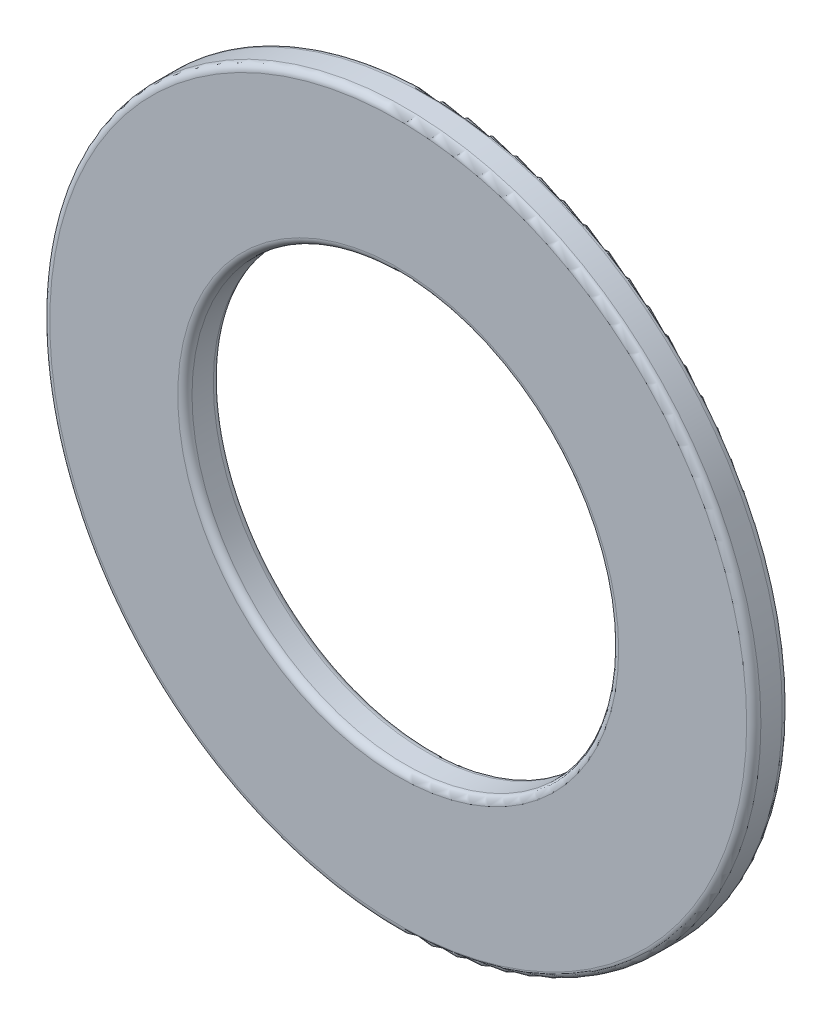
ISO-10303-21;
HEADER;
FILE_DESCRIPTION(('STEP AP214'),'2;1');
FILE_NAME('part.step','',(''),(''),'','','');
FILE_SCHEMA(('AUTOMOTIVE_DESIGN { 1 0 10303 214 1 1 1 1 }'));
ENDSEC;
DATA;
#1=APPLICATION_CONTEXT('core data for automotive mechanical design processes');
#2=APPLICATION_PROTOCOL_DEFINITION('international standard','automotive_design',2000,#1);
#3=PRODUCT_CONTEXT('',#1,'mechanical');
#4=PRODUCT('Part','Part','',(#3));
#5=PRODUCT_RELATED_PRODUCT_CATEGORY('part','',(#4));
#6=PRODUCT_DEFINITION_FORMATION('','',#4);
#7=PRODUCT_DEFINITION_CONTEXT('part definition',#1,'design');
#8=PRODUCT_DEFINITION('design','',#6,#7);
#9=PRODUCT_DEFINITION_SHAPE('','',#8);
#10=(LENGTH_UNIT() NAMED_UNIT(*) SI_UNIT(.MILLI.,.METRE.));
#11=(NAMED_UNIT(*) PLANE_ANGLE_UNIT() SI_UNIT($,.RADIAN.));
#12=(NAMED_UNIT(*) SI_UNIT($,.STERADIAN.) SOLID_ANGLE_UNIT());
#13=UNCERTAINTY_MEASURE_WITH_UNIT(LENGTH_MEASURE(1.E-05),#10,'distance_accuracy_value','');
#14=(GEOMETRIC_REPRESENTATION_CONTEXT(3) GLOBAL_UNCERTAINTY_ASSIGNED_CONTEXT((#13)) GLOBAL_UNIT_ASSIGNED_CONTEXT((#10,
#11,#12)) REPRESENTATION_CONTEXT('',''));
#15=CARTESIAN_POINT('',(0.,0.,0.));
#16=DIRECTION('',(0.,0.,1.));
#17=DIRECTION('',(1.,0.,0.));
#18=AXIS2_PLACEMENT_3D('',#15,#16,#17);
#19=CARTESIAN_POINT('',(0.,0.,0.5));
#20=DIRECTION('',(0.,0.,1.));
#21=DIRECTION('',(1.,0.,0.));
#22=AXIS2_PLACEMENT_3D('',#19,#20,#21);
#23=PLANE('',#22);
#24=CARTESIAN_POINT('',(0.,0.,0.5));
#25=DIRECTION('',(0.,0.,1.));
#26=DIRECTION('',(1.,0.,0.));
#27=AXIS2_PLACEMENT_3D('',#24,#25,#26);
#28=CIRCLE('',#27,3.1);
#29=CARTESIAN_POINT('',(3.1,0.,0.5));
#30=VERTEX_POINT('',#29);
#31=EDGE_CURVE('E53',#30,#30,#28,.F.);
#32=ORIENTED_EDGE('',*,*,#31,.T.);
#33=EDGE_LOOP('',(#32));
#34=FACE_BOUND('',#33,.T.);
#35=CARTESIAN_POINT('',(0.,0.,0.5));
#36=DIRECTION('',(0.,0.,1.));
#37=DIRECTION('',(1.,0.,0.));
#38=AXIS2_PLACEMENT_3D('',#35,#36,#37);
#39=CIRCLE('',#38,4.9);
#40=CARTESIAN_POINT('',(4.9,0.,0.5));
#41=VERTEX_POINT('',#40);
#42=EDGE_CURVE('E56',#41,#41,#39,.T.);
#43=ORIENTED_EDGE('',*,*,#42,.T.);
#44=EDGE_LOOP('',(#43));
#45=FACE_BOUND('',#44,.T.);
#46=ADVANCED_FACE('F33',(#34,#45),#23,.T.);
#47=CARTESIAN_POINT('',(0.,0.,0.));
#48=DIRECTION('',(0.,0.,1.));
#49=DIRECTION('',(1.,0.,0.));
#50=AXIS2_PLACEMENT_3D('',#47,#48,#49);
#51=PLANE('',#50);
#52=CARTESIAN_POINT('',(0.,0.,0.));
#53=DIRECTION('',(0.,0.,1.));
#54=DIRECTION('',(1.,0.,0.));
#55=AXIS2_PLACEMENT_3D('',#52,#53,#54);
#56=CIRCLE('',#55,3.1);
#57=CARTESIAN_POINT('',(3.1,0.,0.));
#58=VERTEX_POINT('',#57);
#59=EDGE_CURVE('E10',#58,#58,#56,.T.);
#60=ORIENTED_EDGE('',*,*,#59,.T.);
#61=EDGE_LOOP('',(#60));
#62=FACE_BOUND('',#61,.T.);
#63=CARTESIAN_POINT('',(0.,0.,0.));
#64=DIRECTION('',(0.,0.,1.));
#65=DIRECTION('',(1.,0.,0.));
#66=AXIS2_PLACEMENT_3D('',#63,#64,#65);
#67=CIRCLE('',#66,4.9);
#68=CARTESIAN_POINT('',(4.9,0.,0.));
#69=VERTEX_POINT('',#68);
#70=EDGE_CURVE('E40',#69,#69,#67,.F.);
#71=ORIENTED_EDGE('',*,*,#70,.T.);
#72=EDGE_LOOP('',(#71));
#73=FACE_BOUND('',#72,.T.);
#74=ADVANCED_FACE('F81',(#62,#73),#51,.F.);
#75=CARTESIAN_POINT('',(0.,0.,0.5));
#76=DIRECTION('',(0.,0.,-1.));
#77=DIRECTION('',(-1.,0.,0.));
#78=AXIS2_PLACEMENT_3D('',#75,#76,#77);
#79=CYLINDRICAL_SURFACE('',#78,5.);
#80=CARTESIAN_POINT('',(0.,0.,0.4));
#81=DIRECTION('',(0.,0.,1.));
#82=DIRECTION('',(1.,0.,0.));
#83=AXIS2_PLACEMENT_3D('',#80,#81,#82);
#84=CIRCLE('',#83,5.);
#85=CARTESIAN_POINT('',(5.,0.,0.4));
#86=VERTEX_POINT('',#85);
#87=EDGE_CURVE('E44',#86,#86,#84,.F.);
#88=ORIENTED_EDGE('',*,*,#87,.T.);
#89=EDGE_LOOP('',(#88));
#90=FACE_BOUND('',#89,.T.);
#91=CARTESIAN_POINT('',(0.,0.,0.1));
#92=DIRECTION('',(0.,0.,1.));
#93=DIRECTION('',(1.,0.,0.));
#94=AXIS2_PLACEMENT_3D('',#91,#92,#93);
#95=CIRCLE('',#94,5.);
#96=CARTESIAN_POINT('',(5.,0.,0.1));
#97=VERTEX_POINT('',#96);
#98=EDGE_CURVE('E48',#97,#97,#95,.T.);
#99=ORIENTED_EDGE('',*,*,#98,.T.);
#100=EDGE_LOOP('',(#99));
#101=FACE_BOUND('',#100,.T.);
#102=ADVANCED_FACE('F87',(#90,#101),#79,.T.);
#103=CARTESIAN_POINT('',(0.,0.,0.5));
#104=DIRECTION('',(0.,0.,-1.));
#105=DIRECTION('',(-1.,0.,0.));
#106=AXIS2_PLACEMENT_3D('',#103,#104,#105);
#107=CYLINDRICAL_SURFACE('',#106,3.);
#108=CARTESIAN_POINT('',(0.,0.,0.4));
#109=DIRECTION('',(0.,0.,1.));
#110=DIRECTION('',(1.,0.,0.));
#111=AXIS2_PLACEMENT_3D('',#108,#109,#110);
#112=CIRCLE('',#111,3.);
#113=CARTESIAN_POINT('',(3.,0.,0.4));
#114=VERTEX_POINT('',#113);
#115=EDGE_CURVE('E59',#114,#114,#112,.T.);
#116=ORIENTED_EDGE('',*,*,#115,.T.);
#117=EDGE_LOOP('',(#116));
#118=FACE_BOUND('',#117,.T.);
#119=CARTESIAN_POINT('',(0.,0.,0.1));
#120=DIRECTION('',(0.,0.,1.));
#121=DIRECTION('',(1.,0.,0.));
#122=AXIS2_PLACEMENT_3D('',#119,#120,#121);
#123=CIRCLE('',#122,3.);
#124=CARTESIAN_POINT('',(3.,0.,0.1));
#125=VERTEX_POINT('',#124);
#126=EDGE_CURVE('E62',#125,#125,#123,.F.);
#127=ORIENTED_EDGE('',*,*,#126,.T.);
#128=EDGE_LOOP('',(#127));
#129=FACE_BOUND('',#128,.T.);
#130=ADVANCED_FACE('F66',(#118,#129),#107,.F.);
#131=CARTESIAN_POINT('',(0.,0.,0.4));
#132=DIRECTION('',(0.,0.,1.));
#133=DIRECTION('',(1.,0.,0.));
#134=AXIS2_PLACEMENT_3D('',#131,#132,#133);
#135=TOROIDAL_SURFACE('',#134,3.1,0.1);
#136=ORIENTED_EDGE('',*,*,#31,.F.);
#137=EDGE_LOOP('',(#136));
#138=FACE_BOUND('',#137,.T.);
#139=ORIENTED_EDGE('',*,*,#115,.F.);
#140=EDGE_LOOP('',(#139));
#141=FACE_BOUND('',#140,.T.);
#142=ADVANCED_FACE('F77',(#138,#141),#135,.T.);
#143=CARTESIAN_POINT('',(0.,0.,0.4));
#144=DIRECTION('',(0.,0.,1.));
#145=DIRECTION('',(1.,0.,0.));
#146=AXIS2_PLACEMENT_3D('',#143,#144,#145);
#147=TOROIDAL_SURFACE('',#146,4.9,0.1);
#148=ORIENTED_EDGE('',*,*,#87,.F.);
#149=EDGE_LOOP('',(#148));
#150=FACE_BOUND('',#149,.T.);
#151=ORIENTED_EDGE('',*,*,#42,.F.);
#152=EDGE_LOOP('',(#151));
#153=FACE_BOUND('',#152,.T.);
#154=ADVANCED_FACE('F71',(#150,#153),#147,.T.);
#155=CARTESIAN_POINT('',(0.,0.,0.1));
#156=DIRECTION('',(0.,0.,1.));
#157=DIRECTION('',(1.,0.,0.));
#158=AXIS2_PLACEMENT_3D('',#155,#156,#157);
#159=TOROIDAL_SURFACE('',#158,3.1,0.1);
#160=ORIENTED_EDGE('',*,*,#126,.F.);
#161=EDGE_LOOP('',(#160));
#162=FACE_BOUND('',#161,.T.);
#163=ORIENTED_EDGE('',*,*,#59,.F.);
#164=EDGE_LOOP('',(#163));
#165=FACE_BOUND('',#164,.T.);
#166=ADVANCED_FACE('F68',(#162,#165),#159,.T.);
#167=CARTESIAN_POINT('',(0.,0.,0.1));
#168=DIRECTION('',(0.,0.,1.));
#169=DIRECTION('',(1.,0.,0.));
#170=AXIS2_PLACEMENT_3D('',#167,#168,#169);
#171=TOROIDAL_SURFACE('',#170,4.9,0.1);
#172=ORIENTED_EDGE('',*,*,#70,.F.);
#173=EDGE_LOOP('',(#172));
#174=FACE_BOUND('',#173,.T.);
#175=ORIENTED_EDGE('',*,*,#98,.F.);
#176=EDGE_LOOP('',(#175));
#177=FACE_BOUND('',#176,.T.);
#178=ADVANCED_FACE('F35',(#174,#177),#171,.T.);
#179=CLOSED_SHELL('',(#46,#74,#102,#130,#142,#154,#166,#178));
#180=MANIFOLD_SOLID_BREP('B2',#179);
#181=ADVANCED_BREP_SHAPE_REPRESENTATION('',(#18,#180),#14);
#182=SHAPE_DEFINITION_REPRESENTATION(#9,#181);
ENDSEC;
END-ISO-10303-21;
